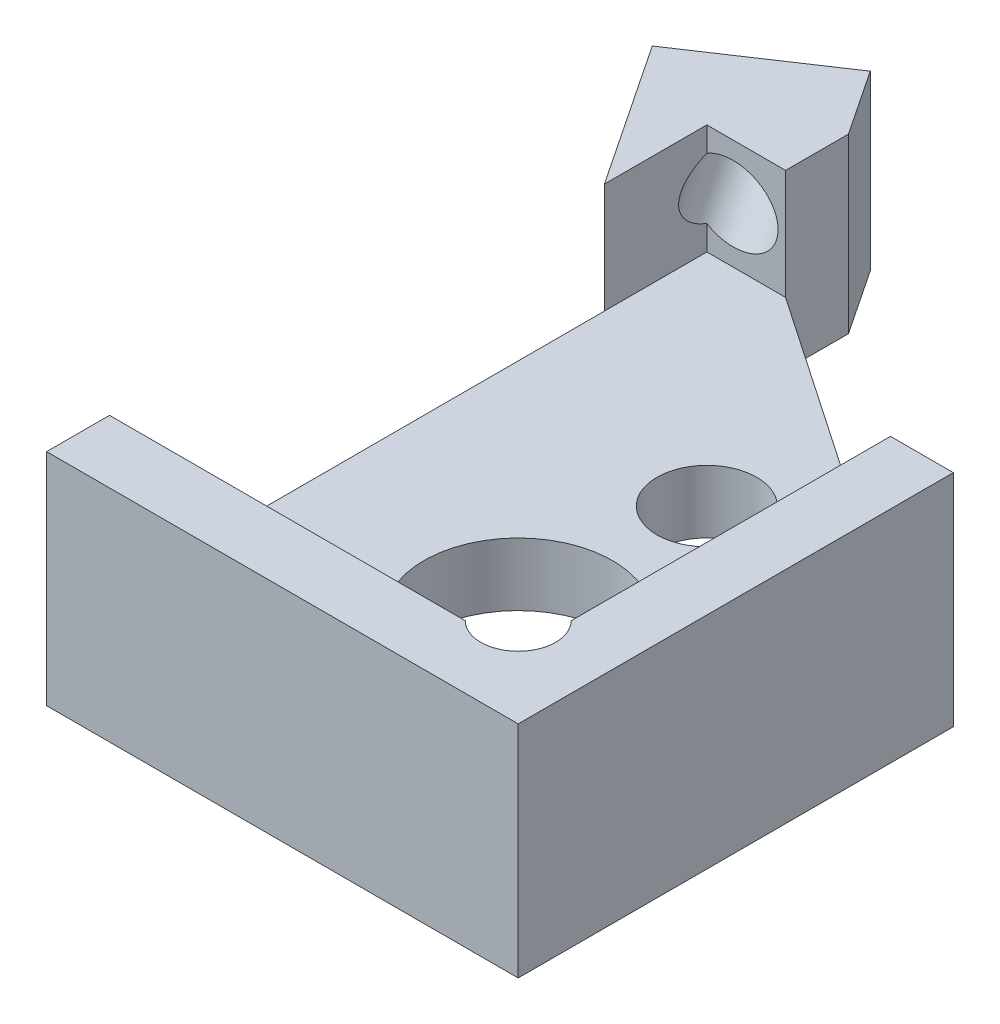
ISO-10303-21;
HEADER;
FILE_DESCRIPTION(('STEP AP214'),'2;1');
FILE_NAME('part.step','',(''),(''),'','','');
FILE_SCHEMA(('AUTOMOTIVE_DESIGN { 1 0 10303 214 1 1 1 1 }'));
ENDSEC;
DATA;
#1=APPLICATION_CONTEXT('core data for automotive mechanical design processes');
#2=APPLICATION_PROTOCOL_DEFINITION('international standard','automotive_design',2000,#1);
#3=PRODUCT_CONTEXT('',#1,'mechanical');
#4=PRODUCT('Part','Part','',(#3));
#5=PRODUCT_RELATED_PRODUCT_CATEGORY('part','',(#4));
#6=PRODUCT_DEFINITION_FORMATION('','',#4);
#7=PRODUCT_DEFINITION_CONTEXT('part definition',#1,'design');
#8=PRODUCT_DEFINITION('design','',#6,#7);
#9=PRODUCT_DEFINITION_SHAPE('','',#8);
#10=(LENGTH_UNIT() NAMED_UNIT(*) SI_UNIT(.MILLI.,.METRE.));
#11=(NAMED_UNIT(*) PLANE_ANGLE_UNIT() SI_UNIT($,.RADIAN.));
#12=(NAMED_UNIT(*) SI_UNIT($,.STERADIAN.) SOLID_ANGLE_UNIT());
#13=UNCERTAINTY_MEASURE_WITH_UNIT(LENGTH_MEASURE(1.E-05),#10,'distance_accuracy_value','');
#14=(GEOMETRIC_REPRESENTATION_CONTEXT(3) GLOBAL_UNCERTAINTY_ASSIGNED_CONTEXT((#13)) GLOBAL_UNIT_ASSIGNED_CONTEXT((#10,
#11,#12)) REPRESENTATION_CONTEXT('',''));
#15=CARTESIAN_POINT('',(0.,0.,0.));
#16=DIRECTION('',(0.,0.,1.));
#17=DIRECTION('',(1.,0.,0.));
#18=AXIS2_PLACEMENT_3D('',#15,#16,#17);
#19=CARTESIAN_POINT('',(4.25,3.5,5.75));
#20=DIRECTION('',(0.,0.,-1.));
#21=DIRECTION('',(-1.,0.,0.));
#22=AXIS2_PLACEMENT_3D('',#19,#20,#21);
#23=PLANE('',#22);
#24=DIRECTION('',(1.,0.,0.));
#25=VECTOR('',#24,1.);
#26=CARTESIAN_POINT('',(4.25,3.5,5.75));
#27=LINE('',#26,#25);
#28=CARTESIAN_POINT('',(-3.25,3.5,5.75));
#29=VERTEX_POINT('',#28);
#30=CARTESIAN_POINT('',(4.25,3.5,5.75));
#31=VERTEX_POINT('',#30);
#32=EDGE_CURVE('E286',#29,#31,#27,.T.);
#33=ORIENTED_EDGE('',*,*,#32,.F.);
#34=DIRECTION('',(0.,1.,0.));
#35=VECTOR('',#34,1.);
#36=CARTESIAN_POINT('',(-3.25,-0.001000000000001,5.75));
#37=LINE('',#36,#35);
#38=CARTESIAN_POINT('',(-3.25,0.,5.75));
#39=VERTEX_POINT('',#38);
#40=EDGE_CURVE('E177',#39,#29,#37,.T.);
#41=ORIENTED_EDGE('',*,*,#40,.F.);
#42=DIRECTION('',(1.,0.,0.));
#43=VECTOR('',#42,1.);
#44=CARTESIAN_POINT('',(4.25,0.,5.75));
#45=LINE('',#44,#43);
#46=CARTESIAN_POINT('',(4.25,0.,5.75));
#47=VERTEX_POINT('',#46);
#48=EDGE_CURVE('E174',#39,#47,#45,.T.);
#49=ORIENTED_EDGE('',*,*,#48,.T.);
#50=DIRECTION('',(0.,-1.,0.));
#51=VECTOR('',#50,1.);
#52=CARTESIAN_POINT('',(4.25,3.5,5.75));
#53=LINE('',#52,#51);
#54=EDGE_CURVE('E292',#31,#47,#53,.T.);
#55=ORIENTED_EDGE('',*,*,#54,.F.);
#56=EDGE_LOOP('',(#33,#41,#49,#55));
#57=FACE_BOUND('',#56,.T.);
#58=ADVANCED_FACE('F40',(#57),#23,.F.);
#59=CARTESIAN_POINT('',(4.25,3.5,-5.75));
#60=DIRECTION('',(-1.,0.,0.));
#61=DIRECTION('',(0.,0.,1.));
#62=AXIS2_PLACEMENT_3D('',#59,#60,#61);
#63=PLANE('',#62);
#64=DIRECTION('',(0.,0.,-1.));
#65=VECTOR('',#64,1.);
#66=CARTESIAN_POINT('',(4.25,0.,-5.75));
#67=LINE('',#66,#65);
#68=CARTESIAN_POINT('',(4.25,0.,-1.17080631760558));
#69=VERTEX_POINT('',#68);
#70=EDGE_CURVE('E289',#47,#69,#67,.T.);
#71=ORIENTED_EDGE('',*,*,#70,.T.);
#72=DIRECTION('',(0.,1.,0.));
#73=VECTOR('',#72,1.);
#74=CARTESIAN_POINT('',(4.25,-0.001000000000001,-1.17080631760558));
#75=LINE('',#74,#73);
#76=CARTESIAN_POINT('',(4.25,3.5,-1.17080631760558));
#77=VERTEX_POINT('',#76);
#78=EDGE_CURVE('E196',#69,#77,#75,.T.);
#79=ORIENTED_EDGE('',*,*,#78,.T.);
#80=DIRECTION('',(0.,0.,-1.));
#81=VECTOR('',#80,1.);
#82=CARTESIAN_POINT('',(4.25,3.5,-5.75));
#83=LINE('',#82,#81);
#84=EDGE_CURVE('E288',#31,#77,#83,.T.);
#85=ORIENTED_EDGE('',*,*,#84,.F.);
#86=ORIENTED_EDGE('',*,*,#54,.T.);
#87=EDGE_LOOP('',(#71,#79,#85,#86));
#88=FACE_BOUND('',#87,.T.);
#89=ADVANCED_FACE('F325',(#88),#63,.F.);
#90=CARTESIAN_POINT('',(0.,3.5,0.));
#91=DIRECTION('',(0.,-1.,0.));
#92=DIRECTION('',(0.,0.,-1.));
#93=AXIS2_PLACEMENT_3D('',#90,#91,#92);
#94=PLANE('',#93);
#95=DIRECTION('',(1.,0.,0.));
#96=VECTOR('',#95,1.);
#97=CARTESIAN_POINT('',(3.25,3.5,4.75));
#98=LINE('',#97,#96);
#99=CARTESIAN_POINT('',(-3.25,3.5,4.75));
#100=VERTEX_POINT('',#99);
#101=CARTESIAN_POINT('',(2.40810098864977,3.5,4.75));
#102=VERTEX_POINT('',#101);
#103=EDGE_CURVE('E260',#100,#102,#98,.T.);
#104=ORIENTED_EDGE('',*,*,#103,.F.);
#105=DIRECTION('',(0.,0.,-1.));
#106=VECTOR('',#105,1.);
#107=CARTESIAN_POINT('',(-3.25,3.5,-3.12166032803723));
#108=LINE('',#107,#106);
#109=EDGE_CURVE('E175',#29,#100,#108,.T.);
#110=ORIENTED_EDGE('',*,*,#109,.F.);
#111=ORIENTED_EDGE('',*,*,#32,.T.);
#112=ORIENTED_EDGE('',*,*,#84,.T.);
#113=DIRECTION('',(1.,0.,0.));
#114=VECTOR('',#113,1.);
#115=CARTESIAN_POINT('',(3.25,3.5,-1.17080631760558));
#116=LINE('',#115,#114);
#117=CARTESIAN_POINT('',(3.25,3.5,-1.17080631760558));
#118=VERTEX_POINT('',#117);
#119=EDGE_CURVE('E193',#118,#77,#116,.T.);
#120=ORIENTED_EDGE('',*,*,#119,.F.);
#121=DIRECTION('',(0.,0.,-1.));
#122=VECTOR('',#121,1.);
#123=CARTESIAN_POINT('',(3.25,3.5,-4.75));
#124=LINE('',#123,#122);
#125=CARTESIAN_POINT('',(3.25,3.5,3.90810098864977));
#126=VERTEX_POINT('',#125);
#127=EDGE_CURVE('E263',#126,#118,#124,.T.);
#128=ORIENTED_EDGE('',*,*,#127,.F.);
#129=CARTESIAN_POINT('',(2.82905049432488,3.5,4.32905049432488));
#130=DIRECTION('',(0.,1.,0.));
#131=DIRECTION('',(0.,0.,1.));
#132=AXIS2_PLACEMENT_3D('',#129,#130,#131);
#133=CIRCLE('',#132,0.595312500000001);
#134=EDGE_CURVE('E247',#102,#126,#133,.T.);
#135=ORIENTED_EDGE('',*,*,#134,.F.);
#136=EDGE_LOOP('',(#104,#110,#111,#112,#120,#128,#135));
#137=FACE_BOUND('',#136,.T.);
#138=ADVANCED_FACE('F333',(#137),#94,.F.);
#139=CARTESIAN_POINT('',(0.,0.,0.));
#140=DIRECTION('',(0.,-1.,0.));
#141=DIRECTION('',(0.,0.,-1.));
#142=AXIS2_PLACEMENT_3D('',#139,#140,#141);
#143=PLANE('',#142);
#144=DIRECTION('',(0.,0.,-1.));
#145=VECTOR('',#144,1.);
#146=CARTESIAN_POINT('',(-3.25,0.,-3.12166032803723));
#147=LINE('',#146,#145);
#148=CARTESIAN_POINT('',(-3.25,0.,-3.12166032803723));
#149=VERTEX_POINT('',#148);
#150=EDGE_CURVE('E164',#39,#149,#147,.T.);
#151=ORIENTED_EDGE('',*,*,#150,.T.);
#152=DIRECTION('',(0.55470019622523,0.,0.832050294337843));
#153=VECTOR('',#152,1.);
#154=CARTESIAN_POINT('',(-4.00154138705974,0.,-4.24897240862684));
#155=LINE('',#154,#153);
#156=CARTESIAN_POINT('',(-4.77077215629051,0.,-5.40281856247299));
#157=VERTEX_POINT('',#156);
#158=EDGE_CURVE('E150',#157,#149,#155,.T.);
#159=ORIENTED_EDGE('',*,*,#158,.F.);
#160=DIRECTION('',(-0.832050294337844,0.,0.554700196225229));
#161=VECTOR('',#160,1.);
#162=CARTESIAN_POINT('',(-2.6906464204459,0.,-6.78956905303607));
#163=LINE('',#162,#161);
#164=CARTESIAN_POINT('',(-2.6906464204459,0.,-6.78956905303607));
#165=VERTEX_POINT('',#164);
#166=EDGE_CURVE('E222',#165,#157,#163,.T.);
#167=ORIENTED_EDGE('',*,*,#166,.F.);
#168=DIRECTION('',(-0.554700196225229,0.,-0.832050294337844));
#169=VECTOR('',#168,1.);
#170=CARTESIAN_POINT('',(-2.6906464204459,0.,-6.78956905303607));
#171=LINE('',#170,#169);
#172=CARTESIAN_POINT('',(-1.99760038508853,0.,-5.75));
#173=VERTEX_POINT('',#172);
#174=EDGE_CURVE('E160',#173,#165,#171,.T.);
#175=ORIENTED_EDGE('',*,*,#174,.F.);
#176=DIRECTION('',(0.,0.,1.));
#177=VECTOR('',#176,1.);
#178=CARTESIAN_POINT('',(-1.99760038508852,0.,-5.75));
#179=LINE('',#178,#177);
#180=CARTESIAN_POINT('',(-1.99760038508852,0.,-4.75));
#181=VERTEX_POINT('',#180);
#182=EDGE_CURVE('E204',#173,#181,#179,.T.);
#183=ORIENTED_EDGE('',*,*,#182,.T.);
#184=DIRECTION('',(0.826133221814283,0.,0.563474843994613));
#185=VECTOR('',#184,1.);
#186=CARTESIAN_POINT('',(-1.99760038508852,0.,-4.75));
#187=LINE('',#186,#185);
#188=CARTESIAN_POINT('',(3.25,0.,-1.17080631760558));
#189=VERTEX_POINT('',#188);
#190=EDGE_CURVE('E187',#181,#189,#187,.T.);
#191=ORIENTED_EDGE('',*,*,#190,.T.);
#192=DIRECTION('',(1.,0.,0.));
#193=VECTOR('',#192,1.);
#194=CARTESIAN_POINT('',(3.25,0.,-1.17080631760558));
#195=LINE('',#194,#193);
#196=EDGE_CURVE('E190',#189,#69,#195,.T.);
#197=ORIENTED_EDGE('',*,*,#196,.T.);
#198=ORIENTED_EDGE('',*,*,#70,.F.);
#199=ORIENTED_EDGE('',*,*,#48,.F.);
#200=EDGE_LOOP('',(#151,#159,#167,#175,#183,#191,#197,#198,#199));
#201=FACE_BOUND('',#200,.T.);
#202=CARTESIAN_POINT('',(2.125,0.,3.5));
#203=DIRECTION('',(0.,1.,0.));
#204=DIRECTION('',(0.,0.,1.));
#205=AXIS2_PLACEMENT_3D('',#202,#203,#204);
#206=CIRCLE('',#205,0.79375);
#207=CARTESIAN_POINT('',(2.125,0.,4.29375));
#208=VERTEX_POINT('',#207);
#209=EDGE_CURVE('E232',#208,#208,#206,.T.);
#210=ORIENTED_EDGE('',*,*,#209,.T.);
#211=EDGE_LOOP('',(#210));
#212=FACE_BOUND('',#211,.T.);
#213=CARTESIAN_POINT('',(-1.625,0.,3.5));
#214=DIRECTION('',(0.,1.,0.));
#215=DIRECTION('',(0.,0.,1.));
#216=AXIS2_PLACEMENT_3D('',#213,#214,#215);
#217=CIRCLE('',#216,0.793750000000001);
#218=CARTESIAN_POINT('',(-1.625,0.,4.29375));
#219=VERTEX_POINT('',#218);
#220=EDGE_CURVE('E238',#219,#219,#217,.T.);
#221=ORIENTED_EDGE('',*,*,#220,.T.);
#222=EDGE_LOOP('',(#221));
#223=FACE_BOUND('',#222,.T.);
#224=CARTESIAN_POINT('',(0.250000000000001,0.,-1.25));
#225=DIRECTION('',(0.,1.,0.));
#226=DIRECTION('',(0.,0.,1.));
#227=AXIS2_PLACEMENT_3D('',#224,#225,#226);
#228=CIRCLE('',#227,0.79375);
#229=CARTESIAN_POINT('',(0.250000000000001,0.,-0.456249999999999));
#230=VERTEX_POINT('',#229);
#231=EDGE_CURVE('E244',#230,#230,#228,.T.);
#232=ORIENTED_EDGE('',*,*,#231,.T.);
#233=EDGE_LOOP('',(#232));
#234=FACE_BOUND('',#233,.T.);
#235=CARTESIAN_POINT('',(0.250000000000001,0.,1.75));
#236=DIRECTION('',(0.,1.,0.));
#237=DIRECTION('',(0.,0.,1.));
#238=AXIS2_PLACEMENT_3D('',#235,#236,#237);
#239=CIRCLE('',#238,1.5);
#240=CARTESIAN_POINT('',(0.250000000000001,0.,3.25));
#241=VERTEX_POINT('',#240);
#242=EDGE_CURVE('E257',#241,#241,#239,.T.);
#243=ORIENTED_EDGE('',*,*,#242,.T.);
#244=EDGE_LOOP('',(#243));
#245=FACE_BOUND('',#244,.T.);
#246=ADVANCED_FACE('F171',(#201,#212,#223,#234,#245),#143,.T.);
#247=CARTESIAN_POINT('',(0.,1.,0.));
#248=DIRECTION('',(0.,-1.,0.));
#249=DIRECTION('',(0.,0.,-1.));
#250=AXIS2_PLACEMENT_3D('',#247,#248,#249);
#251=PLANE('',#250);
#252=CARTESIAN_POINT('',(2.125,1.,3.5));
#253=DIRECTION('',(0.,1.,0.));
#254=DIRECTION('',(0.,0.,1.));
#255=AXIS2_PLACEMENT_3D('',#252,#253,#254);
#256=CIRCLE('',#255,0.79375);
#257=CARTESIAN_POINT('',(2.125,1.,4.29375));
#258=VERTEX_POINT('',#257);
#259=EDGE_CURVE('E231',#258,#258,#256,.T.);
#260=ORIENTED_EDGE('',*,*,#259,.F.);
#261=EDGE_LOOP('',(#260));
#262=FACE_BOUND('',#261,.T.);
#263=CARTESIAN_POINT('',(-1.625,1.,3.5));
#264=DIRECTION('',(0.,1.,0.));
#265=DIRECTION('',(0.,0.,1.));
#266=AXIS2_PLACEMENT_3D('',#263,#264,#265);
#267=CIRCLE('',#266,0.793750000000001);
#268=CARTESIAN_POINT('',(-1.625,1.,4.29375));
#269=VERTEX_POINT('',#268);
#270=EDGE_CURVE('E235',#269,#269,#267,.T.);
#271=ORIENTED_EDGE('',*,*,#270,.F.);
#272=EDGE_LOOP('',(#271));
#273=FACE_BOUND('',#272,.T.);
#274=CARTESIAN_POINT('',(0.250000000000001,1.,-1.25));
#275=DIRECTION('',(0.,1.,0.));
#276=DIRECTION('',(0.,0.,1.));
#277=AXIS2_PLACEMENT_3D('',#274,#275,#276);
#278=CIRCLE('',#277,0.79375);
#279=CARTESIAN_POINT('',(0.250000000000001,1.,-0.456249999999999));
#280=VERTEX_POINT('',#279);
#281=EDGE_CURVE('E241',#280,#280,#278,.T.);
#282=ORIENTED_EDGE('',*,*,#281,.F.);
#283=EDGE_LOOP('',(#282));
#284=FACE_BOUND('',#283,.T.);
#285=CARTESIAN_POINT('',(0.250000000000001,1.,1.75));
#286=DIRECTION('',(0.,1.,0.));
#287=DIRECTION('',(0.,0.,1.));
#288=AXIS2_PLACEMENT_3D('',#285,#286,#287);
#289=CIRCLE('',#288,1.5);
#290=CARTESIAN_POINT('',(0.250000000000001,1.,3.25));
#291=VERTEX_POINT('',#290);
#292=EDGE_CURVE('E256',#291,#291,#289,.T.);
#293=ORIENTED_EDGE('',*,*,#292,.F.);
#294=EDGE_LOOP('',(#293));
#295=FACE_BOUND('',#294,.T.);
#296=DIRECTION('',(0.,0.,-1.));
#297=VECTOR('',#296,1.);
#298=CARTESIAN_POINT('',(3.25,1.,-4.75));
#299=LINE('',#298,#297);
#300=CARTESIAN_POINT('',(3.25,1.,3.90810098864977));
#301=VERTEX_POINT('',#300);
#302=CARTESIAN_POINT('',(3.25,1.,-1.17080631760558));
#303=VERTEX_POINT('',#302);
#304=EDGE_CURVE('E271',#301,#303,#299,.T.);
#305=ORIENTED_EDGE('',*,*,#304,.T.);
#306=DIRECTION('',(0.826133221814283,0.,0.563474843994613));
#307=VECTOR('',#306,1.);
#308=CARTESIAN_POINT('',(-1.99760038508852,1.,-4.75));
#309=LINE('',#308,#307);
#310=CARTESIAN_POINT('',(-1.99760038508852,1.,-4.75));
#311=VERTEX_POINT('',#310);
#312=EDGE_CURVE('E207',#311,#303,#309,.T.);
#313=ORIENTED_EDGE('',*,*,#312,.F.);
#314=DIRECTION('',(-1.,0.,0.));
#315=VECTOR('',#314,1.);
#316=CARTESIAN_POINT('',(3.25,1.,-4.75));
#317=LINE('',#316,#315);
#318=CARTESIAN_POINT('',(-3.25,1.,-4.75));
#319=VERTEX_POINT('',#318);
#320=EDGE_CURVE('E277',#311,#319,#317,.T.);
#321=ORIENTED_EDGE('',*,*,#320,.T.);
#322=DIRECTION('',(0.,0.,1.));
#323=VECTOR('',#322,1.);
#324=CARTESIAN_POINT('',(-3.25,1.,-4.75));
#325=LINE('',#324,#323);
#326=CARTESIAN_POINT('',(-3.25,1.,-3.12166032803723));
#327=VERTEX_POINT('',#326);
#328=EDGE_CURVE('E272',#319,#327,#325,.T.);
#329=ORIENTED_EDGE('',*,*,#328,.T.);
#330=DIRECTION('',(0.,0.,1.));
#331=VECTOR('',#330,1.);
#332=CARTESIAN_POINT('',(-3.25,1.,0.));
#333=LINE('',#332,#331);
#334=CARTESIAN_POINT('',(-3.25,0.999999999999999,4.75));
#335=VERTEX_POINT('',#334);
#336=EDGE_CURVE('E167',#327,#335,#333,.T.);
#337=ORIENTED_EDGE('',*,*,#336,.T.);
#338=DIRECTION('',(1.,0.,0.));
#339=VECTOR('',#338,1.);
#340=CARTESIAN_POINT('',(3.25,1.,4.75));
#341=LINE('',#340,#339);
#342=CARTESIAN_POINT('',(2.40810098864977,1.,4.75));
#343=VERTEX_POINT('',#342);
#344=EDGE_CURVE('E266',#335,#343,#341,.T.);
#345=ORIENTED_EDGE('',*,*,#344,.T.);
#346=CARTESIAN_POINT('',(2.82905049432488,1.,4.32905049432488));
#347=DIRECTION('',(0.,-1.,0.));
#348=DIRECTION('',(0.,0.,-1.));
#349=AXIS2_PLACEMENT_3D('',#346,#347,#348);
#350=CIRCLE('',#349,0.595312500000001);
#351=EDGE_CURVE('E251',#343,#301,#350,.F.);
#352=ORIENTED_EDGE('',*,*,#351,.T.);
#353=EDGE_LOOP('',(#305,#313,#321,#329,#337,#345,#352));
#354=FACE_BOUND('',#353,.T.);
#355=ADVANCED_FACE('F340',(#262,#273,#284,#295,#354),#251,.F.);
#356=CARTESIAN_POINT('',(3.25,-11.5108644332213,4.75));
#357=DIRECTION('',(0.,0.,1.));
#358=DIRECTION('',(1.,0.,0.));
#359=AXIS2_PLACEMENT_3D('',#356,#357,#358);
#360=PLANE('',#359);
#361=ORIENTED_EDGE('',*,*,#103,.T.);
#362=DIRECTION('',(0.,1.,0.));
#363=VECTOR('',#362,1.);
#364=CARTESIAN_POINT('',(2.40810098864977,-0.68379802270047,4.75));
#365=LINE('',#364,#363);
#366=EDGE_CURVE('E253',#102,#343,#365,.F.);
#367=ORIENTED_EDGE('',*,*,#366,.T.);
#368=ORIENTED_EDGE('',*,*,#344,.F.);
#369=DIRECTION('',(0.,1.,0.));
#370=VECTOR('',#369,1.);
#371=CARTESIAN_POINT('',(-3.25,-11.5108644332213,4.75));
#372=LINE('',#371,#370);
#373=EDGE_CURVE('E275',#335,#100,#372,.T.);
#374=ORIENTED_EDGE('',*,*,#373,.T.);
#375=EDGE_LOOP('',(#361,#367,#368,#374));
#376=FACE_BOUND('',#375,.T.);
#377=ADVANCED_FACE('F337',(#376),#360,.F.);
#378=CARTESIAN_POINT('',(3.25,-11.5108644332213,-4.75));
#379=DIRECTION('',(1.,0.,0.));
#380=DIRECTION('',(0.,0.,-1.));
#381=AXIS2_PLACEMENT_3D('',#378,#379,#380);
#382=PLANE('',#381);
#383=ORIENTED_EDGE('',*,*,#127,.T.);
#384=DIRECTION('',(0.,1.,0.));
#385=VECTOR('',#384,1.);
#386=CARTESIAN_POINT('',(3.25,-0.001000000000001,-1.17080631760558));
#387=LINE('',#386,#385);
#388=EDGE_CURVE('E185',#303,#118,#387,.T.);
#389=ORIENTED_EDGE('',*,*,#388,.F.);
#390=ORIENTED_EDGE('',*,*,#304,.F.);
#391=DIRECTION('',(0.,1.,0.));
#392=VECTOR('',#391,1.);
#393=CARTESIAN_POINT('',(3.25,-0.68379802270047,3.90810098864977));
#394=LINE('',#393,#392);
#395=EDGE_CURVE('E298',#301,#126,#394,.T.);
#396=ORIENTED_EDGE('',*,*,#395,.T.);
#397=EDGE_LOOP('',(#383,#389,#390,#396));
#398=FACE_BOUND('',#397,.T.);
#399=ADVANCED_FACE('F377',(#398),#382,.F.);
#400=CARTESIAN_POINT('',(3.25,-11.5108644332213,-4.75));
#401=DIRECTION('',(0.,0.,-1.));
#402=DIRECTION('',(-1.,0.,0.));
#403=AXIS2_PLACEMENT_3D('',#400,#401,#402);
#404=PLANE('',#403);
#405=ORIENTED_EDGE('',*,*,#320,.F.);
#406=DIRECTION('',(0.,-1.,0.));
#407=VECTOR('',#406,1.);
#408=CARTESIAN_POINT('',(-1.99760038508852,-0.001000000000001,-4.75));
#409=LINE('',#408,#407);
#410=CARTESIAN_POINT('',(-1.99760038508852,2.75,-4.75));
#411=VERTEX_POINT('',#410);
#412=EDGE_CURVE('E182',#411,#311,#409,.T.);
#413=ORIENTED_EDGE('',*,*,#412,.F.);
#414=DIRECTION('',(-1.,0.,0.));
#415=VECTOR('',#414,1.);
#416=CARTESIAN_POINT('',(3.25,2.75,-4.75));
#417=LINE('',#416,#415);
#418=CARTESIAN_POINT('',(-3.25,2.75,-4.75));
#419=VERTEX_POINT('',#418);
#420=EDGE_CURVE('E220',#411,#419,#417,.T.);
#421=ORIENTED_EDGE('',*,*,#420,.T.);
#422=DIRECTION('',(0.,1.,0.));
#423=VECTOR('',#422,1.);
#424=CARTESIAN_POINT('',(-3.25,-11.5108644332213,-4.75));
#425=LINE('',#424,#423);
#426=CARTESIAN_POINT('',(-3.25,2.35928589904809,-4.75));
#427=VERTEX_POINT('',#426);
#428=EDGE_CURVE('E279',#427,#419,#425,.T.);
#429=ORIENTED_EDGE('',*,*,#428,.F.);
#430=CARTESIAN_POINT('',(-2.83324674986519,1.875,-4.75));
#431=DIRECTION('',(0.,0.,-1.));
#432=DIRECTION('',(-1.,0.,0.));
#433=AXIS2_PLACEMENT_3D('',#430,#431,#432);
#434=ELLIPSE('',#433,0.715858168734871,0.595629999999999);
#435=CARTESIAN_POINT('',(-3.25,1.39071410095191,-4.75));
#436=VERTEX_POINT('',#435);
#437=EDGE_CURVE('E61',#427,#436,#434,.T.);
#438=ORIENTED_EDGE('',*,*,#437,.T.);
#439=EDGE_CURVE('E276',#319,#436,#425,.T.);
#440=ORIENTED_EDGE('',*,*,#439,.F.);
#441=EDGE_LOOP('',(#405,#413,#421,#429,#438,#440));
#442=FACE_BOUND('',#441,.T.);
#443=ADVANCED_FACE('F347',(#442),#404,.F.);
#444=CARTESIAN_POINT('',(-3.25,-11.5108644332213,-4.75));
#445=DIRECTION('',(-1.,0.,0.));
#446=DIRECTION('',(0.,0.,1.));
#447=AXIS2_PLACEMENT_3D('',#444,#445,#446);
#448=PLANE('',#447);
#449=DIRECTION('',(0.,0.,1.));
#450=VECTOR('',#449,1.);
#451=CARTESIAN_POINT('',(-3.25,2.75,-4.75));
#452=LINE('',#451,#450);
#453=CARTESIAN_POINT('',(-3.25,2.75,-3.12166032803723));
#454=VERTEX_POINT('',#453);
#455=EDGE_CURVE('E217',#419,#454,#452,.T.);
#456=ORIENTED_EDGE('',*,*,#455,.T.);
#457=DIRECTION('',(0.,1.,0.));
#458=VECTOR('',#457,1.);
#459=CARTESIAN_POINT('',(-3.25,-0.001000000000001,-3.12166032803723));
#460=LINE('',#459,#458);
#461=EDGE_CURVE('E168',#327,#454,#460,.T.);
#462=ORIENTED_EDGE('',*,*,#461,.F.);
#463=ORIENTED_EDGE('',*,*,#328,.F.);
#464=ORIENTED_EDGE('',*,*,#439,.T.);
#465=CARTESIAN_POINT('',(-3.25,1.875,-5.37512987520222));
#466=DIRECTION('',(-1.,0.,0.));
#467=DIRECTION('',(0.,0.,-1.));
#468=AXIS2_PLACEMENT_3D('',#465,#466,#467);
#469=ELLIPSE('',#468,1.0737872531023,0.595629999999999);
#470=EDGE_CURVE('E13',#436,#427,#469,.T.);
#471=ORIENTED_EDGE('',*,*,#470,.T.);
#472=ORIENTED_EDGE('',*,*,#428,.T.);
#473=EDGE_LOOP('',(#456,#462,#463,#464,#471,#472));
#474=FACE_BOUND('',#473,.T.);
#475=ADVANCED_FACE('F345',(#474),#448,.F.);
#476=CARTESIAN_POINT('',(0.250000000000001,0.,1.75));
#477=DIRECTION('',(0.,1.,0.));
#478=DIRECTION('',(0.,0.,1.));
#479=AXIS2_PLACEMENT_3D('',#476,#477,#478);
#480=CYLINDRICAL_SURFACE('',#479,1.5);
#481=ORIENTED_EDGE('',*,*,#242,.F.);
#482=EDGE_LOOP('',(#481));
#483=FACE_BOUND('',#482,.T.);
#484=ORIENTED_EDGE('',*,*,#292,.T.);
#485=EDGE_LOOP('',(#484));
#486=FACE_BOUND('',#485,.T.);
#487=ADVANCED_FACE('F385',(#483,#486),#480,.F.);
#488=CARTESIAN_POINT('',(2.82905049432488,-0.68379802270047,4.32905049432488));
#489=DIRECTION('',(0.,1.,0.));
#490=DIRECTION('',(0.,0.,1.));
#491=AXIS2_PLACEMENT_3D('',#488,#489,#490);
#492=CYLINDRICAL_SURFACE('',#491,0.595312500000001);
#493=ORIENTED_EDGE('',*,*,#134,.T.);
#494=ORIENTED_EDGE('',*,*,#395,.F.);
#495=ORIENTED_EDGE('',*,*,#351,.F.);
#496=ORIENTED_EDGE('',*,*,#366,.F.);
#497=EDGE_LOOP('',(#493,#494,#495,#496));
#498=FACE_BOUND('',#497,.T.);
#499=ADVANCED_FACE('F388',(#498),#492,.F.);
#500=CARTESIAN_POINT('',(0.250000000000001,0.,-1.25));
#501=DIRECTION('',(0.,1.,0.));
#502=DIRECTION('',(0.,0.,1.));
#503=AXIS2_PLACEMENT_3D('',#500,#501,#502);
#504=CYLINDRICAL_SURFACE('',#503,0.79375);
#505=ORIENTED_EDGE('',*,*,#231,.F.);
#506=EDGE_LOOP('',(#505));
#507=FACE_BOUND('',#506,.T.);
#508=ORIENTED_EDGE('',*,*,#281,.T.);
#509=EDGE_LOOP('',(#508));
#510=FACE_BOUND('',#509,.T.);
#511=ADVANCED_FACE('F392',(#507,#510),#504,.F.);
#512=CARTESIAN_POINT('',(-1.625,0.,3.5));
#513=DIRECTION('',(0.,1.,0.));
#514=DIRECTION('',(0.,0.,1.));
#515=AXIS2_PLACEMENT_3D('',#512,#513,#514);
#516=CYLINDRICAL_SURFACE('',#515,0.793750000000001);
#517=ORIENTED_EDGE('',*,*,#220,.F.);
#518=EDGE_LOOP('',(#517));
#519=FACE_BOUND('',#518,.T.);
#520=ORIENTED_EDGE('',*,*,#270,.T.);
#521=EDGE_LOOP('',(#520));
#522=FACE_BOUND('',#521,.T.);
#523=ADVANCED_FACE('F396',(#519,#522),#516,.F.);
#524=CARTESIAN_POINT('',(2.125,0.,3.5));
#525=DIRECTION('',(0.,1.,0.));
#526=DIRECTION('',(0.,0.,1.));
#527=AXIS2_PLACEMENT_3D('',#524,#525,#526);
#528=CYLINDRICAL_SURFACE('',#527,0.79375);
#529=ORIENTED_EDGE('',*,*,#209,.F.);
#530=EDGE_LOOP('',(#529));
#531=FACE_BOUND('',#530,.T.);
#532=ORIENTED_EDGE('',*,*,#259,.T.);
#533=EDGE_LOOP('',(#532));
#534=FACE_BOUND('',#533,.T.);
#535=ADVANCED_FACE('F400',(#531,#534),#528,.F.);
#536=CARTESIAN_POINT('',(-2.6906464204459,-3.81752063551709,-6.78956905303607));
#537=DIRECTION('',(-0.554700196225229,0.,-0.832050294337843));
#538=DIRECTION('',(-0.832050294337844,0.,0.554700196225229));
#539=AXIS2_PLACEMENT_3D('',#536,#537,#538);
#540=PLANE('',#539);
#541=CARTESIAN_POINT('',(-3.73070928836821,1.875,-6.09619380775453));
#542=DIRECTION('',(-0.55470019622523,0.,-0.832050294337843));
#543=DIRECTION('',(-0.832050294337843,0.,0.55470019622523));
#544=AXIS2_PLACEMENT_3D('',#541,#542,#543);
#545=CIRCLE('',#544,0.595629999999999);
#546=CARTESIAN_POINT('',(-4.22630340518466,1.875,-5.7657977298769));
#547=VERTEX_POINT('',#546);
#548=EDGE_CURVE('E210',#547,#547,#545,.T.);
#549=ORIENTED_EDGE('',*,*,#548,.F.);
#550=EDGE_LOOP('',(#549));
#551=FACE_BOUND('',#550,.T.);
#552=DIRECTION('',(-0.832050294337844,0.,0.554700196225229));
#553=VECTOR('',#552,1.);
#554=CARTESIAN_POINT('',(-2.6906464204459,2.75,-6.78956905303607));
#555=LINE('',#554,#553);
#556=CARTESIAN_POINT('',(-2.6906464204459,2.75,-6.78956905303607));
#557=VERTEX_POINT('',#556);
#558=CARTESIAN_POINT('',(-4.77077215629051,2.75,-5.40281856247299));
#559=VERTEX_POINT('',#558);
#560=EDGE_CURVE('E214',#557,#559,#555,.T.);
#561=ORIENTED_EDGE('',*,*,#560,.F.);
#562=DIRECTION('',(0.,1.,0.));
#563=VECTOR('',#562,1.);
#564=CARTESIAN_POINT('',(-2.6906464204459,-3.81752063551709,-6.78956905303607));
#565=LINE('',#564,#563);
#566=EDGE_CURVE('E224',#165,#557,#565,.T.);
#567=ORIENTED_EDGE('',*,*,#566,.F.);
#568=ORIENTED_EDGE('',*,*,#166,.T.);
#569=DIRECTION('',(0.,1.,0.));
#570=VECTOR('',#569,1.);
#571=CARTESIAN_POINT('',(-4.77077215629051,-3.81752063551709,-5.40281856247299));
#572=LINE('',#571,#570);
#573=EDGE_CURVE('E156',#157,#559,#572,.T.);
#574=ORIENTED_EDGE('',*,*,#573,.T.);
#575=EDGE_LOOP('',(#561,#567,#568,#574));
#576=FACE_BOUND('',#575,.T.);
#577=ADVANCED_FACE('F309',(#551,#576),#540,.T.);
#578=CARTESIAN_POINT('',(-4.00154138705974,-3.81752063551709,-4.24897240862684));
#579=DIRECTION('',(-0.832050294337843,0.,0.55470019622523));
#580=DIRECTION('',(0.55470019622523,0.,0.832050294337843));
#581=AXIS2_PLACEMENT_3D('',#578,#579,#580);
#582=PLANE('',#581);
#583=DIRECTION('',(0.55470019622523,0.,0.832050294337843));
#584=VECTOR('',#583,1.);
#585=CARTESIAN_POINT('',(-4.00154138705974,2.75,-4.24897240862684));
#586=LINE('',#585,#584);
#587=EDGE_CURVE('E54',#559,#454,#586,.T.);
#588=ORIENTED_EDGE('',*,*,#587,.F.);
#589=ORIENTED_EDGE('',*,*,#573,.F.);
#590=ORIENTED_EDGE('',*,*,#158,.T.);
#591=EDGE_CURVE('E153',#149,#327,#460,.T.);
#592=ORIENTED_EDGE('',*,*,#591,.T.);
#593=ORIENTED_EDGE('',*,*,#461,.T.);
#594=EDGE_LOOP('',(#588,#589,#590,#592,#593));
#595=FACE_BOUND('',#594,.T.);
#596=ADVANCED_FACE('F152',(#595),#582,.T.);
#597=CARTESIAN_POINT('',(-2.6906464204459,-3.81752063551709,-6.78956905303607));
#598=DIRECTION('',(0.832050294337844,0.,-0.554700196225229));
#599=DIRECTION('',(-0.554700196225229,0.,-0.832050294337844));
#600=AXIS2_PLACEMENT_3D('',#597,#598,#599);
#601=PLANE('',#600);
#602=DIRECTION('',(-0.554700196225229,0.,-0.832050294337844));
#603=VECTOR('',#602,1.);
#604=CARTESIAN_POINT('',(-2.6906464204459,2.75,-6.78956905303607));
#605=LINE('',#604,#603);
#606=CARTESIAN_POINT('',(-1.99760038508853,2.75,-5.75));
#607=VERTEX_POINT('',#606);
#608=EDGE_CURVE('E47',#607,#557,#605,.T.);
#609=ORIENTED_EDGE('',*,*,#608,.F.);
#610=DIRECTION('',(0.,1.,0.));
#611=VECTOR('',#610,1.);
#612=CARTESIAN_POINT('',(-1.99760038508853,3.5,-5.75));
#613=LINE('',#612,#611);
#614=EDGE_CURVE('E229',#173,#607,#613,.T.);
#615=ORIENTED_EDGE('',*,*,#614,.F.);
#616=ORIENTED_EDGE('',*,*,#174,.T.);
#617=ORIENTED_EDGE('',*,*,#566,.T.);
#618=EDGE_LOOP('',(#609,#615,#616,#617));
#619=FACE_BOUND('',#618,.T.);
#620=ADVANCED_FACE('F310',(#619),#601,.T.);
#621=CARTESIAN_POINT('',(0.,2.75,0.));
#622=DIRECTION('',(0.,-1.,0.));
#623=DIRECTION('',(0.,0.,-1.));
#624=AXIS2_PLACEMENT_3D('',#621,#622,#623);
#625=PLANE('',#624);
#626=ORIENTED_EDGE('',*,*,#587,.T.);
#627=ORIENTED_EDGE('',*,*,#455,.F.);
#628=ORIENTED_EDGE('',*,*,#420,.F.);
#629=DIRECTION('',(0.,0.,1.));
#630=VECTOR('',#629,1.);
#631=CARTESIAN_POINT('',(-1.99760038508852,2.75,-5.75));
#632=LINE('',#631,#630);
#633=EDGE_CURVE('E199',#607,#411,#632,.T.);
#634=ORIENTED_EDGE('',*,*,#633,.F.);
#635=ORIENTED_EDGE('',*,*,#608,.T.);
#636=ORIENTED_EDGE('',*,*,#560,.T.);
#637=EDGE_LOOP('',(#626,#627,#628,#634,#635,#636));
#638=FACE_BOUND('',#637,.T.);
#639=ADVANCED_FACE('F303',(#638),#625,.F.);
#640=CARTESIAN_POINT('',(-3.73070928836821,1.875,-6.09619380775453));
#641=DIRECTION('',(-0.55470019622523,0.,-0.832050294337843));
#642=DIRECTION('',(-0.832050294337843,0.,0.55470019622523));
#643=AXIS2_PLACEMENT_3D('',#640,#641,#642);
#644=CYLINDRICAL_SURFACE('',#643,0.595629999999999);
#645=ORIENTED_EDGE('',*,*,#548,.T.);
#646=EDGE_LOOP('',(#645));
#647=FACE_BOUND('',#646,.T.);
#648=ORIENTED_EDGE('',*,*,#470,.F.);
#649=ORIENTED_EDGE('',*,*,#437,.F.);
#650=EDGE_LOOP('',(#648,#649));
#651=FACE_BOUND('',#650,.T.);
#652=ADVANCED_FACE('F350',(#647,#651),#644,.F.);
#653=CARTESIAN_POINT('',(-1.99760038508852,-0.001000000000001,-4.75));
#654=DIRECTION('',(-0.563474843994613,0.,0.826133221814283));
#655=DIRECTION('',(0.826133221814283,0.,0.563474843994613));
#656=AXIS2_PLACEMENT_3D('',#653,#654,#655);
#657=PLANE('',#656);
#658=DIRECTION('',(0.,1.,0.));
#659=VECTOR('',#658,1.);
#660=CARTESIAN_POINT('',(-1.99760038508852,-0.001000000000001,-4.75));
#661=LINE('',#660,#659);
#662=EDGE_CURVE('E195',#181,#311,#661,.T.);
#663=ORIENTED_EDGE('',*,*,#662,.T.);
#664=ORIENTED_EDGE('',*,*,#312,.T.);
#665=DIRECTION('',(0.,1.,0.));
#666=VECTOR('',#665,1.);
#667=CARTESIAN_POINT('',(3.25,-0.001000000000001,-1.17080631760558));
#668=LINE('',#667,#666);
#669=EDGE_CURVE('E200',#189,#303,#668,.T.);
#670=ORIENTED_EDGE('',*,*,#669,.F.);
#671=ORIENTED_EDGE('',*,*,#190,.F.);
#672=EDGE_LOOP('',(#663,#664,#670,#671));
#673=FACE_BOUND('',#672,.T.);
#674=ADVANCED_FACE('F318',(#673),#657,.F.);
#675=CARTESIAN_POINT('',(-1.99760038508852,-0.001000000000001,-5.75));
#676=DIRECTION('',(-1.,0.,0.));
#677=DIRECTION('',(0.,0.,1.));
#678=AXIS2_PLACEMENT_3D('',#675,#676,#677);
#679=PLANE('',#678);
#680=ORIENTED_EDGE('',*,*,#614,.T.);
#681=ORIENTED_EDGE('',*,*,#633,.T.);
#682=ORIENTED_EDGE('',*,*,#412,.T.);
#683=ORIENTED_EDGE('',*,*,#662,.F.);
#684=ORIENTED_EDGE('',*,*,#182,.F.);
#685=EDGE_LOOP('',(#680,#681,#682,#683,#684));
#686=FACE_BOUND('',#685,.T.);
#687=ADVANCED_FACE('F314',(#686),#679,.F.);
#688=CARTESIAN_POINT('',(3.25,-0.001000000000001,-1.17080631760558));
#689=DIRECTION('',(0.,0.,1.));
#690=DIRECTION('',(1.,0.,0.));
#691=AXIS2_PLACEMENT_3D('',#688,#689,#690);
#692=PLANE('',#691);
#693=ORIENTED_EDGE('',*,*,#669,.T.);
#694=ORIENTED_EDGE('',*,*,#388,.T.);
#695=ORIENTED_EDGE('',*,*,#119,.T.);
#696=ORIENTED_EDGE('',*,*,#78,.F.);
#697=ORIENTED_EDGE('',*,*,#196,.F.);
#698=EDGE_LOOP('',(#693,#694,#695,#696,#697));
#699=FACE_BOUND('',#698,.T.);
#700=ADVANCED_FACE('F322',(#699),#692,.F.);
#701=CARTESIAN_POINT('',(-3.25,-0.001000000000001,-3.12166032803723));
#702=DIRECTION('',(1.,0.,0.));
#703=DIRECTION('',(0.,0.,-1.));
#704=AXIS2_PLACEMENT_3D('',#701,#702,#703);
#705=PLANE('',#704);
#706=ORIENTED_EDGE('',*,*,#591,.F.);
#707=ORIENTED_EDGE('',*,*,#150,.F.);
#708=ORIENTED_EDGE('',*,*,#40,.T.);
#709=ORIENTED_EDGE('',*,*,#109,.T.);
#710=ORIENTED_EDGE('',*,*,#373,.F.);
#711=ORIENTED_EDGE('',*,*,#336,.F.);
#712=EDGE_LOOP('',(#706,#707,#708,#709,#710,#711));
#713=FACE_BOUND('',#712,.T.);
#714=ADVANCED_FACE('F163',(#713),#705,.F.);
#715=CLOSED_SHELL('',(#58,#89,#138,#246,#355,#377,#399,#443,#475,#487,#499,#511,#523,#535,#577,
#596,#620,#639,#652,#674,#687,#700,#714));
#716=MANIFOLD_SOLID_BREP('B2',#715);
#717=ADVANCED_BREP_SHAPE_REPRESENTATION('',(#18,#716),#14);
#718=SHAPE_DEFINITION_REPRESENTATION(#9,#717);
ENDSEC;
END-ISO-10303-21;
